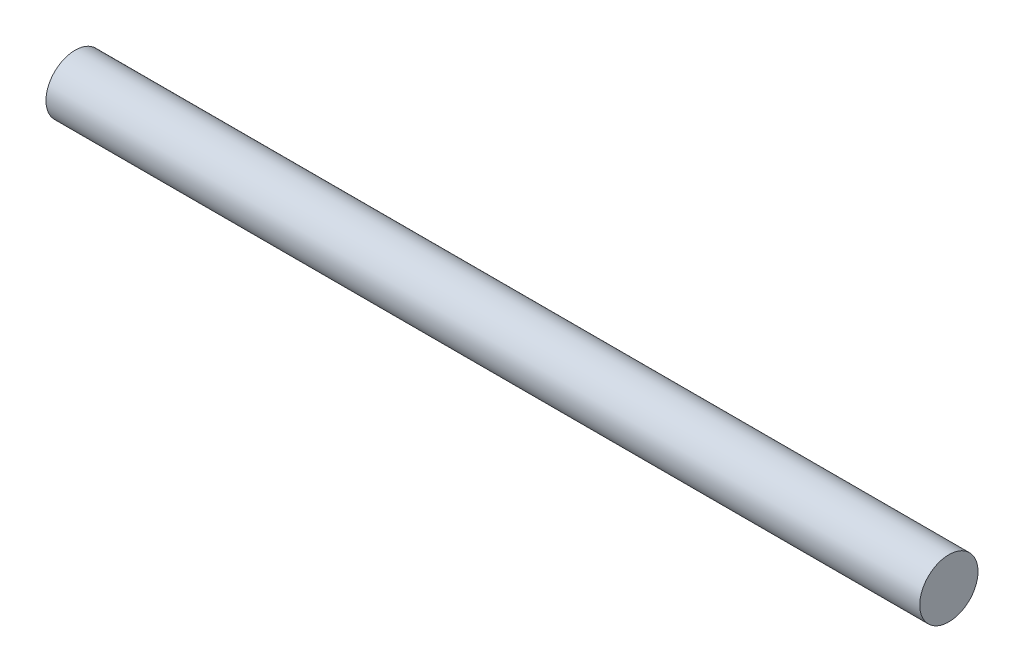
ISO-10303-21;
HEADER;
FILE_DESCRIPTION(('STEP AP214'),'2;1');
FILE_NAME('part.step','',(''),(''),'','','');
FILE_SCHEMA(('AUTOMOTIVE_DESIGN { 1 0 10303 214 1 1 1 1 }'));
ENDSEC;
DATA;
#1=APPLICATION_CONTEXT('core data for automotive mechanical design processes');
#2=APPLICATION_PROTOCOL_DEFINITION('international standard','automotive_design',2000,#1);
#3=PRODUCT_CONTEXT('',#1,'mechanical');
#4=PRODUCT('Part','Part','',(#3));
#5=PRODUCT_RELATED_PRODUCT_CATEGORY('part','',(#4));
#6=PRODUCT_DEFINITION_FORMATION('','',#4);
#7=PRODUCT_DEFINITION_CONTEXT('part definition',#1,'design');
#8=PRODUCT_DEFINITION('design','',#6,#7);
#9=PRODUCT_DEFINITION_SHAPE('','',#8);
#10=(LENGTH_UNIT() NAMED_UNIT(*) SI_UNIT(.MILLI.,.METRE.));
#11=(NAMED_UNIT(*) PLANE_ANGLE_UNIT() SI_UNIT($,.RADIAN.));
#12=(NAMED_UNIT(*) SI_UNIT($,.STERADIAN.) SOLID_ANGLE_UNIT());
#13=UNCERTAINTY_MEASURE_WITH_UNIT(LENGTH_MEASURE(1.E-05),#10,'distance_accuracy_value','');
#14=(GEOMETRIC_REPRESENTATION_CONTEXT(3) GLOBAL_UNCERTAINTY_ASSIGNED_CONTEXT((#13)) GLOBAL_UNIT_ASSIGNED_CONTEXT((#10,
#11,#12)) REPRESENTATION_CONTEXT('',''));
#15=CARTESIAN_POINT('',(0.,0.,0.));
#16=DIRECTION('',(0.,0.,1.));
#17=DIRECTION('',(1.,0.,0.));
#18=AXIS2_PLACEMENT_3D('',#15,#16,#17);
#19=CARTESIAN_POINT('',(150.,0.,0.));
#20=DIRECTION('',(-1.,0.,0.));
#21=DIRECTION('',(0.,0.,1.));
#22=AXIS2_PLACEMENT_3D('',#19,#20,#21);
#23=CYLINDRICAL_SURFACE('',#22,5.);
#24=CARTESIAN_POINT('',(150.,0.,0.));
#25=DIRECTION('',(1.,0.,0.));
#26=DIRECTION('',(0.,0.,-1.));
#27=AXIS2_PLACEMENT_3D('',#24,#25,#26);
#28=CIRCLE('',#27,5.);
#29=CARTESIAN_POINT('',(150.,0.,-5.));
#30=VERTEX_POINT('',#29);
#31=EDGE_CURVE('E10',#30,#30,#28,.T.);
#32=ORIENTED_EDGE('',*,*,#31,.F.);
#33=EDGE_LOOP('',(#32));
#34=FACE_BOUND('',#33,.T.);
#35=CARTESIAN_POINT('',(0.,0.,0.));
#36=DIRECTION('',(1.,0.,0.));
#37=DIRECTION('',(0.,0.,-1.));
#38=AXIS2_PLACEMENT_3D('',#35,#36,#37);
#39=CIRCLE('',#38,5.);
#40=CARTESIAN_POINT('',(0.,0.,-5.));
#41=VERTEX_POINT('',#40);
#42=EDGE_CURVE('E32',#41,#41,#39,.T.);
#43=ORIENTED_EDGE('',*,*,#42,.T.);
#44=EDGE_LOOP('',(#43));
#45=FACE_BOUND('',#44,.T.);
#46=ADVANCED_FACE('F29',(#34,#45),#23,.T.);
#47=CARTESIAN_POINT('',(150.,0.,0.));
#48=DIRECTION('',(1.,0.,0.));
#49=DIRECTION('',(0.,0.,-1.));
#50=AXIS2_PLACEMENT_3D('',#47,#48,#49);
#51=PLANE('',#50);
#52=ORIENTED_EDGE('',*,*,#31,.T.);
#53=EDGE_LOOP('',(#52));
#54=FACE_BOUND('',#53,.T.);
#55=ADVANCED_FACE('F44',(#54),#51,.T.);
#56=CARTESIAN_POINT('',(0.,0.,0.));
#57=DIRECTION('',(1.,0.,0.));
#58=DIRECTION('',(0.,0.,-1.));
#59=AXIS2_PLACEMENT_3D('',#56,#57,#58);
#60=PLANE('',#59);
#61=ORIENTED_EDGE('',*,*,#42,.F.);
#62=EDGE_LOOP('',(#61));
#63=FACE_BOUND('',#62,.T.);
#64=ADVANCED_FACE('F42',(#63),#60,.F.);
#65=CLOSED_SHELL('',(#46,#55,#64));
#66=MANIFOLD_SOLID_BREP('B2',#65);
#67=ADVANCED_BREP_SHAPE_REPRESENTATION('',(#18,#66),#14);
#68=SHAPE_DEFINITION_REPRESENTATION(#9,#67);
ENDSEC;
END-ISO-10303-21;
